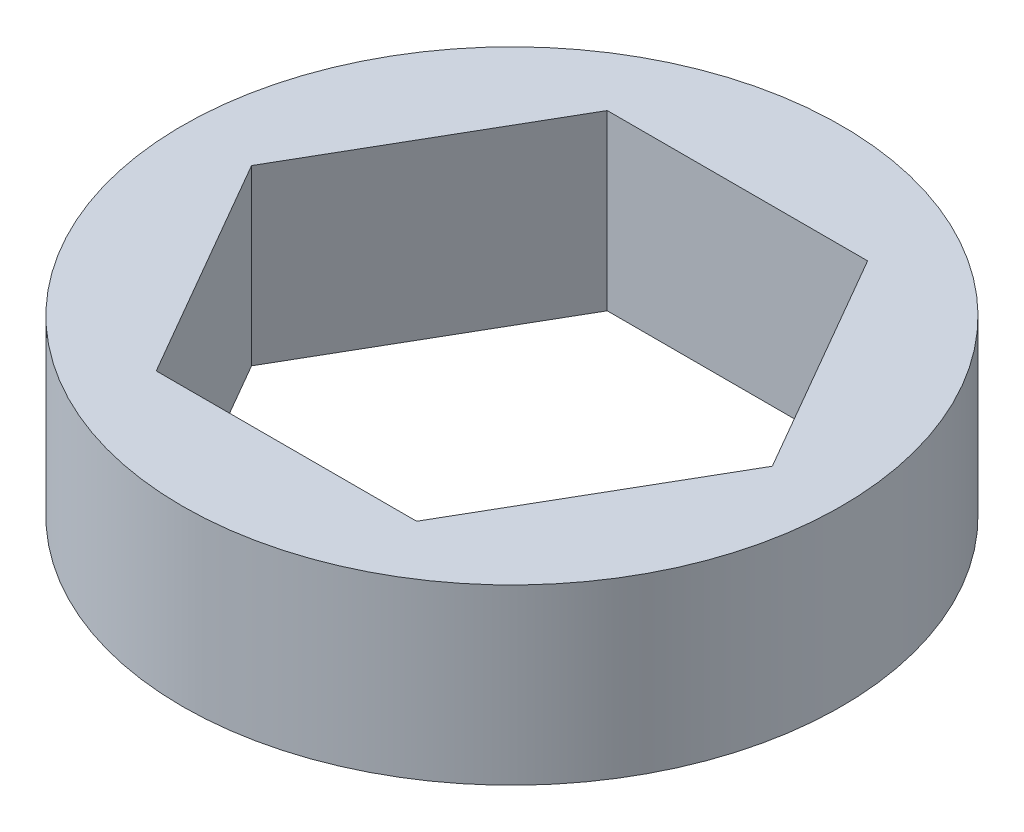
ISO-10303-21;
HEADER;
FILE_DESCRIPTION(('STEP AP214'),'2;1');
FILE_NAME('part.step','',(''),(''),'','','');
FILE_SCHEMA(('AUTOMOTIVE_DESIGN { 1 0 10303 214 1 1 1 1 }'));
ENDSEC;
DATA;
#1=APPLICATION_CONTEXT('core data for automotive mechanical design processes');
#2=APPLICATION_PROTOCOL_DEFINITION('international standard','automotive_design',2000,#1);
#3=PRODUCT_CONTEXT('',#1,'mechanical');
#4=PRODUCT('Part','Part','',(#3));
#5=PRODUCT_RELATED_PRODUCT_CATEGORY('part','',(#4));
#6=PRODUCT_DEFINITION_FORMATION('','',#4);
#7=PRODUCT_DEFINITION_CONTEXT('part definition',#1,'design');
#8=PRODUCT_DEFINITION('design','',#6,#7);
#9=PRODUCT_DEFINITION_SHAPE('','',#8);
#10=(LENGTH_UNIT() NAMED_UNIT(*) SI_UNIT(.MILLI.,.METRE.));
#11=(NAMED_UNIT(*) PLANE_ANGLE_UNIT() SI_UNIT($,.RADIAN.));
#12=(NAMED_UNIT(*) SI_UNIT($,.STERADIAN.) SOLID_ANGLE_UNIT());
#13=UNCERTAINTY_MEASURE_WITH_UNIT(LENGTH_MEASURE(1.E-05),#10,'distance_accuracy_value','');
#14=(GEOMETRIC_REPRESENTATION_CONTEXT(3) GLOBAL_UNCERTAINTY_ASSIGNED_CONTEXT((#13)) GLOBAL_UNIT_ASSIGNED_CONTEXT((#10,
#11,#12)) REPRESENTATION_CONTEXT('',''));
#15=CARTESIAN_POINT('',(0.,0.,0.));
#16=DIRECTION('',(0.,0.,1.));
#17=DIRECTION('',(1.,0.,0.));
#18=AXIS2_PLACEMENT_3D('',#15,#16,#17);
#19=CARTESIAN_POINT('',(0.,5.,0.));
#20=DIRECTION('',(0.,1.,0.));
#21=DIRECTION('',(0.,0.,1.));
#22=AXIS2_PLACEMENT_3D('',#19,#20,#21);
#23=PLANE('',#22);
#24=CARTESIAN_POINT('',(0.,5.,0.));
#25=DIRECTION('',(0.,1.,0.));
#26=DIRECTION('',(0.,0.,1.));
#27=AXIS2_PLACEMENT_3D('',#24,#25,#26);
#28=CIRCLE('',#27,9.5);
#29=CARTESIAN_POINT('',(0.,5.,9.5));
#30=VERTEX_POINT('',#29);
#31=EDGE_CURVE('E11',#30,#30,#28,.T.);
#32=ORIENTED_EDGE('',*,*,#31,.T.);
#33=EDGE_LOOP('',(#32));
#34=FACE_BOUND('',#33,.T.);
#35=DIRECTION('',(-0.5,0.,-0.866025403784439));
#36=VECTOR('',#35,1.);
#37=CARTESIAN_POINT('',(7.50555349946513,5.,0.));
#38=LINE('',#37,#36);
#39=CARTESIAN_POINT('',(7.50555349946513,5.,0.));
#40=VERTEX_POINT('',#39);
#41=CARTESIAN_POINT('',(3.75277674973257,5.,-6.5));
#42=VERTEX_POINT('',#41);
#43=EDGE_CURVE('E103',#40,#42,#38,.T.);
#44=ORIENTED_EDGE('',*,*,#43,.F.);
#45=DIRECTION('',(0.5,0.,-0.866025403784439));
#46=VECTOR('',#45,1.);
#47=CARTESIAN_POINT('',(3.75277674973257,5.,6.5));
#48=LINE('',#47,#46);
#49=CARTESIAN_POINT('',(3.75277674973257,5.,6.5));
#50=VERTEX_POINT('',#49);
#51=EDGE_CURVE('E94',#50,#40,#48,.T.);
#52=ORIENTED_EDGE('',*,*,#51,.F.);
#53=DIRECTION('',(1.,0.,0.));
#54=VECTOR('',#53,1.);
#55=CARTESIAN_POINT('',(-3.75277674973257,5.,6.5));
#56=LINE('',#55,#54);
#57=CARTESIAN_POINT('',(-3.75277674973257,5.,6.5));
#58=VERTEX_POINT('',#57);
#59=EDGE_CURVE('E128',#58,#50,#56,.T.);
#60=ORIENTED_EDGE('',*,*,#59,.F.);
#61=DIRECTION('',(0.5,0.,0.866025403784439));
#62=VECTOR('',#61,1.);
#63=CARTESIAN_POINT('',(-7.50555349946514,5.,0.));
#64=LINE('',#63,#62);
#65=CARTESIAN_POINT('',(-7.50555349946514,5.,0.));
#66=VERTEX_POINT('',#65);
#67=EDGE_CURVE('E125',#66,#58,#64,.T.);
#68=ORIENTED_EDGE('',*,*,#67,.F.);
#69=DIRECTION('',(-0.5,0.,0.866025403784439));
#70=VECTOR('',#69,1.);
#71=CARTESIAN_POINT('',(-3.75277674973257,5.,-6.5));
#72=LINE('',#71,#70);
#73=CARTESIAN_POINT('',(-3.75277674973257,5.,-6.5));
#74=VERTEX_POINT('',#73);
#75=EDGE_CURVE('E120',#74,#66,#72,.T.);
#76=ORIENTED_EDGE('',*,*,#75,.F.);
#77=DIRECTION('',(-1.,0.,0.));
#78=VECTOR('',#77,1.);
#79=CARTESIAN_POINT('',(3.75277674973257,5.,-6.5));
#80=LINE('',#79,#78);
#81=EDGE_CURVE('E116',#42,#74,#80,.T.);
#82=ORIENTED_EDGE('',*,*,#81,.F.);
#83=EDGE_LOOP('',(#44,#52,#60,#68,#76,#82));
#84=FACE_BOUND('',#83,.T.);
#85=ADVANCED_FACE('F40',(#34,#84),#23,.T.);
#86=CARTESIAN_POINT('',(0.,0.,0.));
#87=DIRECTION('',(0.,1.,0.));
#88=DIRECTION('',(0.,0.,1.));
#89=AXIS2_PLACEMENT_3D('',#86,#87,#88);
#90=PLANE('',#89);
#91=CARTESIAN_POINT('',(0.,0.,0.));
#92=DIRECTION('',(0.,1.,0.));
#93=DIRECTION('',(0.,0.,1.));
#94=AXIS2_PLACEMENT_3D('',#91,#92,#93);
#95=CIRCLE('',#94,9.5);
#96=CARTESIAN_POINT('',(0.,0.,9.5));
#97=VERTEX_POINT('',#96);
#98=EDGE_CURVE('E44',#97,#97,#95,.T.);
#99=ORIENTED_EDGE('',*,*,#98,.F.);
#100=EDGE_LOOP('',(#99));
#101=FACE_BOUND('',#100,.T.);
#102=DIRECTION('',(0.5,0.,-0.866025403784439));
#103=VECTOR('',#102,1.);
#104=CARTESIAN_POINT('',(3.75277674973257,0.,6.5));
#105=LINE('',#104,#103);
#106=CARTESIAN_POINT('',(3.75277674973257,0.,6.5));
#107=VERTEX_POINT('',#106);
#108=CARTESIAN_POINT('',(7.50555349946513,0.,0.));
#109=VERTEX_POINT('',#108);
#110=EDGE_CURVE('E64',#107,#109,#105,.T.);
#111=ORIENTED_EDGE('',*,*,#110,.T.);
#112=DIRECTION('',(-0.5,0.,-0.866025403784439));
#113=VECTOR('',#112,1.);
#114=CARTESIAN_POINT('',(7.50555349946513,0.,0.));
#115=LINE('',#114,#113);
#116=CARTESIAN_POINT('',(3.75277674973257,0.,-6.5));
#117=VERTEX_POINT('',#116);
#118=EDGE_CURVE('E110',#109,#117,#115,.T.);
#119=ORIENTED_EDGE('',*,*,#118,.T.);
#120=DIRECTION('',(-1.,0.,0.));
#121=VECTOR('',#120,1.);
#122=CARTESIAN_POINT('',(3.75277674973257,0.,-6.5));
#123=LINE('',#122,#121);
#124=CARTESIAN_POINT('',(-3.75277674973257,0.,-6.5));
#125=VERTEX_POINT('',#124);
#126=EDGE_CURVE('E135',#117,#125,#123,.T.);
#127=ORIENTED_EDGE('',*,*,#126,.T.);
#128=DIRECTION('',(-0.5,0.,0.866025403784439));
#129=VECTOR('',#128,1.);
#130=CARTESIAN_POINT('',(-3.75277674973257,0.,-6.5));
#131=LINE('',#130,#129);
#132=CARTESIAN_POINT('',(-7.50555349946514,0.,0.));
#133=VERTEX_POINT('',#132);
#134=EDGE_CURVE('E139',#125,#133,#131,.T.);
#135=ORIENTED_EDGE('',*,*,#134,.T.);
#136=DIRECTION('',(0.5,0.,0.866025403784439));
#137=VECTOR('',#136,1.);
#138=CARTESIAN_POINT('',(-7.50555349946514,0.,0.));
#139=LINE('',#138,#137);
#140=CARTESIAN_POINT('',(-3.75277674973257,0.,6.5));
#141=VERTEX_POINT('',#140);
#142=EDGE_CURVE('E143',#133,#141,#139,.T.);
#143=ORIENTED_EDGE('',*,*,#142,.T.);
#144=DIRECTION('',(1.,0.,0.));
#145=VECTOR('',#144,1.);
#146=CARTESIAN_POINT('',(-3.75277674973257,0.,6.5));
#147=LINE('',#146,#145);
#148=EDGE_CURVE('E104',#141,#107,#147,.T.);
#149=ORIENTED_EDGE('',*,*,#148,.T.);
#150=EDGE_LOOP('',(#111,#119,#127,#135,#143,#149));
#151=FACE_BOUND('',#150,.T.);
#152=ADVANCED_FACE('F167',(#101,#151),#90,.F.);
#153=CARTESIAN_POINT('',(0.,5.,0.));
#154=DIRECTION('',(0.,-1.,0.));
#155=DIRECTION('',(0.,0.,-1.));
#156=AXIS2_PLACEMENT_3D('',#153,#154,#155);
#157=CYLINDRICAL_SURFACE('',#156,9.5);
#158=ORIENTED_EDGE('',*,*,#31,.F.);
#159=EDGE_LOOP('',(#158));
#160=FACE_BOUND('',#159,.T.);
#161=ORIENTED_EDGE('',*,*,#98,.T.);
#162=EDGE_LOOP('',(#161));
#163=FACE_BOUND('',#162,.T.);
#164=ADVANCED_FACE('F42',(#160,#163),#157,.T.);
#165=CARTESIAN_POINT('',(3.75277674973257,5.,6.5));
#166=DIRECTION('',(-0.866025403784439,0.,-0.5));
#167=DIRECTION('',(-0.5,0.,0.866025403784439));
#168=AXIS2_PLACEMENT_3D('',#165,#166,#167);
#169=PLANE('',#168);
#170=ORIENTED_EDGE('',*,*,#110,.F.);
#171=DIRECTION('',(0.,-1.,0.));
#172=VECTOR('',#171,1.);
#173=CARTESIAN_POINT('',(3.75277674973257,5.,6.5));
#174=LINE('',#173,#172);
#175=EDGE_CURVE('E98',#50,#107,#174,.T.);
#176=ORIENTED_EDGE('',*,*,#175,.F.);
#177=ORIENTED_EDGE('',*,*,#51,.T.);
#178=DIRECTION('',(0.,-1.,0.));
#179=VECTOR('',#178,1.);
#180=CARTESIAN_POINT('',(7.50555349946513,5.,0.));
#181=LINE('',#180,#179);
#182=EDGE_CURVE('E97',#40,#109,#181,.T.);
#183=ORIENTED_EDGE('',*,*,#182,.T.);
#184=EDGE_LOOP('',(#170,#176,#177,#183));
#185=FACE_BOUND('',#184,.T.);
#186=ADVANCED_FACE('F96',(#185),#169,.T.);
#187=CARTESIAN_POINT('',(7.50555349946513,5.,0.));
#188=DIRECTION('',(-0.866025403784439,0.,0.5));
#189=DIRECTION('',(0.5,0.,0.866025403784439));
#190=AXIS2_PLACEMENT_3D('',#187,#188,#189);
#191=PLANE('',#190);
#192=ORIENTED_EDGE('',*,*,#118,.F.);
#193=ORIENTED_EDGE('',*,*,#182,.F.);
#194=ORIENTED_EDGE('',*,*,#43,.T.);
#195=DIRECTION('',(0.,-1.,0.));
#196=VECTOR('',#195,1.);
#197=CARTESIAN_POINT('',(3.75277674973257,5.,-6.5));
#198=LINE('',#197,#196);
#199=EDGE_CURVE('E112',#42,#117,#198,.T.);
#200=ORIENTED_EDGE('',*,*,#199,.T.);
#201=EDGE_LOOP('',(#192,#193,#194,#200));
#202=FACE_BOUND('',#201,.T.);
#203=ADVANCED_FACE('F107',(#202),#191,.T.);
#204=CARTESIAN_POINT('',(3.75277674973257,5.,-6.5));
#205=DIRECTION('',(0.,0.,1.));
#206=DIRECTION('',(1.,0.,0.));
#207=AXIS2_PLACEMENT_3D('',#204,#205,#206);
#208=PLANE('',#207);
#209=ORIENTED_EDGE('',*,*,#126,.F.);
#210=ORIENTED_EDGE('',*,*,#199,.F.);
#211=ORIENTED_EDGE('',*,*,#81,.T.);
#212=DIRECTION('',(0.,-1.,0.));
#213=VECTOR('',#212,1.);
#214=CARTESIAN_POINT('',(-3.75277674973257,5.,-6.5));
#215=LINE('',#214,#213);
#216=EDGE_CURVE('E157',#74,#125,#215,.T.);
#217=ORIENTED_EDGE('',*,*,#216,.T.);
#218=EDGE_LOOP('',(#209,#210,#211,#217));
#219=FACE_BOUND('',#218,.T.);
#220=ADVANCED_FACE('F163',(#219),#208,.T.);
#221=CARTESIAN_POINT('',(-3.75277674973257,5.,-6.5));
#222=DIRECTION('',(0.866025403784439,0.,0.5));
#223=DIRECTION('',(0.5,0.,-0.866025403784439));
#224=AXIS2_PLACEMENT_3D('',#221,#222,#223);
#225=PLANE('',#224);
#226=ORIENTED_EDGE('',*,*,#134,.F.);
#227=ORIENTED_EDGE('',*,*,#216,.F.);
#228=ORIENTED_EDGE('',*,*,#75,.T.);
#229=DIRECTION('',(0.,-1.,0.));
#230=VECTOR('',#229,1.);
#231=CARTESIAN_POINT('',(-7.50555349946514,5.,0.));
#232=LINE('',#231,#230);
#233=EDGE_CURVE('E154',#66,#133,#232,.T.);
#234=ORIENTED_EDGE('',*,*,#233,.T.);
#235=EDGE_LOOP('',(#226,#227,#228,#234));
#236=FACE_BOUND('',#235,.T.);
#237=ADVANCED_FACE('F175',(#236),#225,.T.);
#238=CARTESIAN_POINT('',(-7.50555349946514,5.,0.));
#239=DIRECTION('',(0.866025403784439,0.,-0.5));
#240=DIRECTION('',(-0.5,0.,-0.866025403784439));
#241=AXIS2_PLACEMENT_3D('',#238,#239,#240);
#242=PLANE('',#241);
#243=ORIENTED_EDGE('',*,*,#142,.F.);
#244=ORIENTED_EDGE('',*,*,#233,.F.);
#245=ORIENTED_EDGE('',*,*,#67,.T.);
#246=DIRECTION('',(0.,-1.,0.));
#247=VECTOR('',#246,1.);
#248=CARTESIAN_POINT('',(-3.75277674973257,5.,6.5));
#249=LINE('',#248,#247);
#250=EDGE_CURVE('E56',#58,#141,#249,.T.);
#251=ORIENTED_EDGE('',*,*,#250,.T.);
#252=EDGE_LOOP('',(#243,#244,#245,#251));
#253=FACE_BOUND('',#252,.T.);
#254=ADVANCED_FACE('F173',(#253),#242,.T.);
#255=CARTESIAN_POINT('',(-3.75277674973257,5.,6.5));
#256=DIRECTION('',(0.,0.,-1.));
#257=DIRECTION('',(-1.,0.,0.));
#258=AXIS2_PLACEMENT_3D('',#255,#256,#257);
#259=PLANE('',#258);
#260=ORIENTED_EDGE('',*,*,#148,.F.);
#261=ORIENTED_EDGE('',*,*,#250,.F.);
#262=ORIENTED_EDGE('',*,*,#59,.T.);
#263=ORIENTED_EDGE('',*,*,#175,.T.);
#264=EDGE_LOOP('',(#260,#261,#262,#263));
#265=FACE_BOUND('',#264,.T.);
#266=ADVANCED_FACE('F169',(#265),#259,.T.);
#267=CLOSED_SHELL('',(#85,#152,#164,#186,#203,#220,#237,#254,#266));
#268=MANIFOLD_SOLID_BREP('B2',#267);
#269=ADVANCED_BREP_SHAPE_REPRESENTATION('',(#18,#268),#14);
#270=SHAPE_DEFINITION_REPRESENTATION(#9,#269);
ENDSEC;
END-ISO-10303-21;
